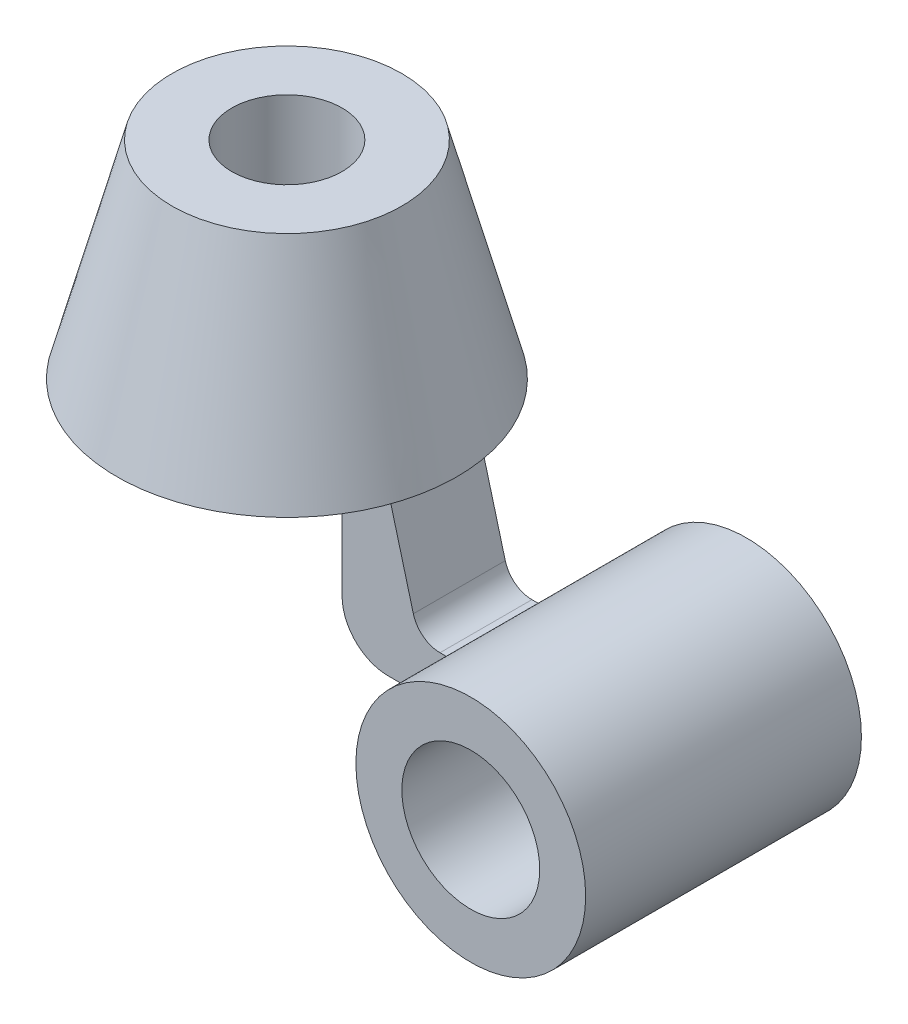
ISO-10303-21;
HEADER;
FILE_DESCRIPTION(('STEP AP214'),'2;1');
FILE_NAME('part.step','',(''),(''),'','','');
FILE_SCHEMA(('AUTOMOTIVE_DESIGN { 1 0 10303 214 1 1 1 1 }'));
ENDSEC;
DATA;
#1=APPLICATION_CONTEXT('core data for automotive mechanical design processes');
#2=APPLICATION_PROTOCOL_DEFINITION('international standard','automotive_design',2000,#1);
#3=PRODUCT_CONTEXT('',#1,'mechanical');
#4=PRODUCT('Part','Part','',(#3));
#5=PRODUCT_RELATED_PRODUCT_CATEGORY('part','',(#4));
#6=PRODUCT_DEFINITION_FORMATION('','',#4);
#7=PRODUCT_DEFINITION_CONTEXT('part definition',#1,'design');
#8=PRODUCT_DEFINITION('design','',#6,#7);
#9=PRODUCT_DEFINITION_SHAPE('','',#8);
#10=(LENGTH_UNIT() NAMED_UNIT(*) SI_UNIT(.MILLI.,.METRE.));
#11=(NAMED_UNIT(*) PLANE_ANGLE_UNIT() SI_UNIT($,.RADIAN.));
#12=(NAMED_UNIT(*) SI_UNIT($,.STERADIAN.) SOLID_ANGLE_UNIT());
#13=UNCERTAINTY_MEASURE_WITH_UNIT(LENGTH_MEASURE(1.E-05),#10,'distance_accuracy_value','');
#14=(GEOMETRIC_REPRESENTATION_CONTEXT(3) GLOBAL_UNCERTAINTY_ASSIGNED_CONTEXT((#13)) GLOBAL_UNIT_ASSIGNED_CONTEXT((#10,
#11,#12)) REPRESENTATION_CONTEXT('',''));
#15=CARTESIAN_POINT('',(0.,0.,0.));
#16=DIRECTION('',(0.,0.,1.));
#17=DIRECTION('',(1.,0.,0.));
#18=AXIS2_PLACEMENT_3D('',#15,#16,#17);
#19=CARTESIAN_POINT('',(37.,0.,0.));
#20=DIRECTION('',(0.,-1.,0.));
#21=DIRECTION('',(0.,0.,-1.));
#22=AXIS2_PLACEMENT_3D('',#19,#20,#21);
#23=PLANE('',#22);
#24=CARTESIAN_POINT('',(0.,0.,0.));
#25=DIRECTION('',(0.,-1.,0.));
#26=DIRECTION('',(0.,0.,-1.));
#27=AXIS2_PLACEMENT_3D('',#24,#25,#26);
#28=CIRCLE('',#27,12.);
#29=CARTESIAN_POINT('',(0.,0.,-12.));
#30=VERTEX_POINT('',#29);
#31=EDGE_CURVE('E47',#30,#30,#28,.T.);
#32=ORIENTED_EDGE('',*,*,#31,.F.);
#33=EDGE_LOOP('',(#32));
#34=FACE_BOUND('',#33,.T.);
#35=CARTESIAN_POINT('',(0.,0.,0.));
#36=DIRECTION('',(0.,-1.,0.));
#37=DIRECTION('',(0.,0.,-1.));
#38=AXIS2_PLACEMENT_3D('',#35,#36,#37);
#39=CIRCLE('',#38,37.);
#40=CARTESIAN_POINT('',(0.,0.,-37.));
#41=VERTEX_POINT('',#40);
#42=EDGE_CURVE('E143',#41,#41,#39,.T.);
#43=ORIENTED_EDGE('',*,*,#42,.T.);
#44=EDGE_LOOP('',(#43));
#45=FACE_BOUND('',#44,.T.);
#46=DIRECTION('',(0.,0.,1.));
#47=VECTOR('',#46,1.);
#48=CARTESIAN_POINT('',(32.,0.,-10.));
#49=LINE('',#48,#47);
#50=CARTESIAN_POINT('',(32.,0.,-10.));
#51=VERTEX_POINT('',#50);
#52=CARTESIAN_POINT('',(32.,0.,10.));
#53=VERTEX_POINT('',#52);
#54=EDGE_CURVE('E192',#51,#53,#49,.T.);
#55=ORIENTED_EDGE('',*,*,#54,.F.);
#56=DIRECTION('',(-1.,0.,0.));
#57=VECTOR('',#56,1.);
#58=CARTESIAN_POINT('',(32.,0.,-10.));
#59=LINE('',#58,#57);
#60=CARTESIAN_POINT('',(22.,0.,-10.));
#61=VERTEX_POINT('',#60);
#62=EDGE_CURVE('E174',#51,#61,#59,.T.);
#63=ORIENTED_EDGE('',*,*,#62,.T.);
#64=DIRECTION('',(0.,0.,1.));
#65=VECTOR('',#64,1.);
#66=CARTESIAN_POINT('',(22.,0.,-10.));
#67=LINE('',#66,#65);
#68=CARTESIAN_POINT('',(22.,0.,10.));
#69=VERTEX_POINT('',#68);
#70=EDGE_CURVE('E191',#61,#69,#67,.T.);
#71=ORIENTED_EDGE('',*,*,#70,.T.);
#72=DIRECTION('',(-1.,0.,0.));
#73=VECTOR('',#72,1.);
#74=CARTESIAN_POINT('',(32.,0.,10.));
#75=LINE('',#74,#73);
#76=EDGE_CURVE('E248',#53,#69,#75,.T.);
#77=ORIENTED_EDGE('',*,*,#76,.F.);
#78=EDGE_LOOP('',(#55,#63,#71,#77));
#79=FACE_BOUND('',#78,.T.);
#80=ADVANCED_FACE('F43',(#34,#45,#79),#23,.T.);
#81=CARTESIAN_POINT('',(0.,45.,0.));
#82=DIRECTION('',(0.,1.,0.));
#83=DIRECTION('',(0.,0.,1.));
#84=AXIS2_PLACEMENT_3D('',#81,#82,#83);
#85=PLANE('',#84);
#86=CARTESIAN_POINT('',(0.,45.,0.));
#87=DIRECTION('',(0.,1.,0.));
#88=DIRECTION('',(0.,0.,1.));
#89=AXIS2_PLACEMENT_3D('',#86,#87,#88);
#90=CIRCLE('',#89,12.);
#91=CARTESIAN_POINT('',(0.,45.,12.));
#92=VERTEX_POINT('',#91);
#93=EDGE_CURVE('E265',#92,#92,#90,.T.);
#94=ORIENTED_EDGE('',*,*,#93,.F.);
#95=EDGE_LOOP('',(#94));
#96=FACE_BOUND('',#95,.T.);
#97=CARTESIAN_POINT('',(0.,45.,0.));
#98=DIRECTION('',(0.,-1.,0.));
#99=DIRECTION('',(0.,0.,-1.));
#100=AXIS2_PLACEMENT_3D('',#97,#98,#99);
#101=CIRCLE('',#100,25.);
#102=CARTESIAN_POINT('',(0.,45.,-25.));
#103=VERTEX_POINT('',#102);
#104=EDGE_CURVE('E136',#103,#103,#101,.T.);
#105=ORIENTED_EDGE('',*,*,#104,.F.);
#106=EDGE_LOOP('',(#105));
#107=FACE_BOUND('',#106,.T.);
#108=ADVANCED_FACE('F206',(#96,#107),#85,.T.);
#109=CARTESIAN_POINT('',(0.,0.,0.));
#110=DIRECTION('',(0.,-1.,0.));
#111=DIRECTION('',(0.,0.,-1.));
#112=AXIS2_PLACEMENT_3D('',#109,#110,#111);
#113=CONICAL_SURFACE('',#112,37.,0.260602391747341);
#114=ORIENTED_EDGE('',*,*,#104,.T.);
#115=EDGE_LOOP('',(#114));
#116=FACE_BOUND('',#115,.T.);
#117=ORIENTED_EDGE('',*,*,#42,.F.);
#118=EDGE_LOOP('',(#117));
#119=FACE_BOUND('',#118,.T.);
#120=ADVANCED_FACE('F203',(#116,#119),#113,.T.);
#121=CARTESIAN_POINT('',(38.6987298107779,-25.,-10.));
#122=DIRECTION('',(0.96592582628907,0.258819045102515,0.));
#123=DIRECTION('',(-0.258819045102515,0.96592582628907,0.));
#124=AXIS2_PLACEMENT_3D('',#121,#122,#123);
#125=PLANE('',#124);
#126=DIRECTION('',(-0.258819045102515,0.96592582628907,0.));
#127=VECTOR('',#126,1.);
#128=CARTESIAN_POINT('',(38.6987298107779,-25.,10.));
#129=LINE('',#128,#127);
#130=CARTESIAN_POINT('',(37.5071367809173,-20.5529142706151,10.));
#131=VERTEX_POINT('',#130);
#132=EDGE_CURVE('E171',#131,#53,#129,.T.);
#133=ORIENTED_EDGE('',*,*,#132,.F.);
#134=DIRECTION('',(0.,0.,1.));
#135=VECTOR('',#134,1.);
#136=CARTESIAN_POINT('',(37.5071367809173,-20.5529142706151,-10.));
#137=LINE('',#136,#135);
#138=CARTESIAN_POINT('',(37.5071367809173,-20.5529142706151,-10.));
#139=VERTEX_POINT('',#138);
#140=EDGE_CURVE('E60',#131,#139,#137,.F.);
#141=ORIENTED_EDGE('',*,*,#140,.T.);
#142=DIRECTION('',(-0.258819045102515,0.96592582628907,0.));
#143=VECTOR('',#142,1.);
#144=CARTESIAN_POINT('',(38.6987298107779,-25.,-10.));
#145=LINE('',#144,#143);
#146=EDGE_CURVE('E188',#139,#51,#145,.T.);
#147=ORIENTED_EDGE('',*,*,#146,.T.);
#148=ORIENTED_EDGE('',*,*,#54,.T.);
#149=EDGE_LOOP('',(#133,#141,#147,#148));
#150=FACE_BOUND('',#149,.T.);
#151=ADVANCED_FACE('F205',(#150),#125,.T.);
#152=CARTESIAN_POINT('',(74.4739299118833,-25.,-10.));
#153=DIRECTION('',(0.,1.,0.));
#154=DIRECTION('',(-1.,0.,0.));
#155=AXIS2_PLACEMENT_3D('',#152,#153,#154);
#156=PLANE('',#155);
#157=DIRECTION('',(-1.,0.,0.));
#158=VECTOR('',#157,1.);
#159=CARTESIAN_POINT('',(74.4739299118833,-25.,-10.));
#160=LINE('',#159,#158);
#161=CARTESIAN_POINT('',(47.0871215252208,-25.,-10.));
#162=VERTEX_POINT('',#161);
#163=CARTESIAN_POINT('',(43.3026917386517,-25.,-10.));
#164=VERTEX_POINT('',#163);
#165=EDGE_CURVE('E167',#162,#164,#160,.T.);
#166=ORIENTED_EDGE('',*,*,#165,.T.);
#167=DIRECTION('',(0.,0.,1.));
#168=VECTOR('',#167,1.);
#169=CARTESIAN_POINT('',(43.3026917386517,-25.,10.));
#170=LINE('',#169,#168);
#171=CARTESIAN_POINT('',(43.3026917386517,-25.,10.));
#172=VERTEX_POINT('',#171);
#173=EDGE_CURVE('E155',#164,#172,#170,.T.);
#174=ORIENTED_EDGE('',*,*,#173,.T.);
#175=DIRECTION('',(-1.,0.,0.));
#176=VECTOR('',#175,1.);
#177=CARTESIAN_POINT('',(74.4739299118833,-25.,10.));
#178=LINE('',#177,#176);
#179=CARTESIAN_POINT('',(47.0871215252208,-25.,10.));
#180=VERTEX_POINT('',#179);
#181=EDGE_CURVE('E117',#180,#172,#178,.T.);
#182=ORIENTED_EDGE('',*,*,#181,.F.);
#183=DIRECTION('',(0.,0.,1.));
#184=VECTOR('',#183,1.);
#185=CARTESIAN_POINT('',(47.0871215252208,-25.,-30.));
#186=LINE('',#185,#184);
#187=EDGE_CURVE('E129',#162,#180,#186,.T.);
#188=ORIENTED_EDGE('',*,*,#187,.F.);
#189=EDGE_LOOP('',(#166,#174,#182,#188));
#190=FACE_BOUND('',#189,.T.);
#191=ADVANCED_FACE('F165',(#190),#156,.T.);
#192=CARTESIAN_POINT('',(22.,-35.,-10.));
#193=DIRECTION('',(0.,-1.,0.));
#194=DIRECTION('',(0.,0.,-1.));
#195=AXIS2_PLACEMENT_3D('',#192,#193,#194);
#196=PLANE('',#195);
#197=DIRECTION('',(1.,0.,0.));
#198=VECTOR('',#197,1.);
#199=CARTESIAN_POINT('',(22.,-35.,10.));
#200=LINE('',#199,#198);
#201=CARTESIAN_POINT('',(32.,-35.,10.));
#202=VERTEX_POINT('',#201);
#203=CARTESIAN_POINT('',(45.,-35.,10.));
#204=VERTEX_POINT('',#203);
#205=EDGE_CURVE('E106',#202,#204,#200,.T.);
#206=ORIENTED_EDGE('',*,*,#205,.F.);
#207=DIRECTION('',(0.,0.,1.));
#208=VECTOR('',#207,1.);
#209=CARTESIAN_POINT('',(32.,-35.,-10.));
#210=LINE('',#209,#208);
#211=CARTESIAN_POINT('',(32.,-35.,-10.));
#212=VERTEX_POINT('',#211);
#213=EDGE_CURVE('E149',#202,#212,#210,.F.);
#214=ORIENTED_EDGE('',*,*,#213,.T.);
#215=DIRECTION('',(1.,0.,0.));
#216=VECTOR('',#215,1.);
#217=CARTESIAN_POINT('',(22.,-35.,-10.));
#218=LINE('',#217,#216);
#219=CARTESIAN_POINT('',(45.,-35.,-10.));
#220=VERTEX_POINT('',#219);
#221=EDGE_CURVE('E124',#212,#220,#218,.T.);
#222=ORIENTED_EDGE('',*,*,#221,.T.);
#223=DIRECTION('',(0.,0.,1.));
#224=VECTOR('',#223,1.);
#225=CARTESIAN_POINT('',(45.,-35.,-30.));
#226=LINE('',#225,#224);
#227=EDGE_CURVE('E121',#204,#220,#226,.F.);
#228=ORIENTED_EDGE('',*,*,#227,.F.);
#229=EDGE_LOOP('',(#206,#214,#222,#228));
#230=FACE_BOUND('',#229,.T.);
#231=ADVANCED_FACE('F122',(#230),#196,.T.);
#232=CARTESIAN_POINT('',(22.,0.,-10.));
#233=DIRECTION('',(-1.,0.,0.));
#234=DIRECTION('',(0.,-1.,0.));
#235=AXIS2_PLACEMENT_3D('',#232,#233,#234);
#236=PLANE('',#235);
#237=DIRECTION('',(0.,-1.,0.));
#238=VECTOR('',#237,1.);
#239=CARTESIAN_POINT('',(22.,0.,-10.));
#240=LINE('',#239,#238);
#241=CARTESIAN_POINT('',(22.,-25.,-10.));
#242=VERTEX_POINT('',#241);
#243=EDGE_CURVE('E180',#61,#242,#240,.T.);
#244=ORIENTED_EDGE('',*,*,#243,.T.);
#245=DIRECTION('',(0.,0.,1.));
#246=VECTOR('',#245,1.);
#247=CARTESIAN_POINT('',(22.,-25.,-10.));
#248=LINE('',#247,#246);
#249=CARTESIAN_POINT('',(22.,-25.,10.));
#250=VERTEX_POINT('',#249);
#251=EDGE_CURVE('E135',#242,#250,#248,.T.);
#252=ORIENTED_EDGE('',*,*,#251,.T.);
#253=DIRECTION('',(0.,-1.,0.));
#254=VECTOR('',#253,1.);
#255=CARTESIAN_POINT('',(22.,0.,10.));
#256=LINE('',#255,#254);
#257=EDGE_CURVE('E118',#69,#250,#256,.T.);
#258=ORIENTED_EDGE('',*,*,#257,.F.);
#259=ORIENTED_EDGE('',*,*,#70,.F.);
#260=EDGE_LOOP('',(#244,#252,#258,#259));
#261=FACE_BOUND('',#260,.T.);
#262=ADVANCED_FACE('F243',(#261),#236,.T.);
#263=CARTESIAN_POINT('',(0.,0.,-10.));
#264=DIRECTION('',(0.,0.,1.));
#265=DIRECTION('',(1.,0.,0.));
#266=AXIS2_PLACEMENT_3D('',#263,#264,#265);
#267=PLANE('',#266);
#268=ORIENTED_EDGE('',*,*,#221,.F.);
#269=CARTESIAN_POINT('',(32.,-25.,-10.));
#270=DIRECTION('',(0.,0.,1.));
#271=DIRECTION('',(1.,0.,0.));
#272=AXIS2_PLACEMENT_3D('',#269,#270,#271);
#273=CIRCLE('',#272,10.);
#274=EDGE_CURVE('E152',#212,#242,#273,.F.);
#275=ORIENTED_EDGE('',*,*,#274,.T.);
#276=ORIENTED_EDGE('',*,*,#243,.F.);
#277=ORIENTED_EDGE('',*,*,#62,.F.);
#278=ORIENTED_EDGE('',*,*,#146,.F.);
#279=CARTESIAN_POINT('',(43.3026917386517,-19.,-10.));
#280=DIRECTION('',(0.,0.,1.));
#281=DIRECTION('',(1.,0.,0.));
#282=AXIS2_PLACEMENT_3D('',#279,#280,#281);
#283=CIRCLE('',#282,6.);
#284=EDGE_CURVE('E11',#139,#164,#283,.T.);
#285=ORIENTED_EDGE('',*,*,#284,.T.);
#286=ORIENTED_EDGE('',*,*,#165,.F.);
#287=CARTESIAN_POINT('',(70.,-35.,-10.));
#288=DIRECTION('',(0.,0.,1.));
#289=DIRECTION('',(1.,0.,0.));
#290=AXIS2_PLACEMENT_3D('',#287,#288,#289);
#291=CIRCLE('',#290,25.);
#292=EDGE_CURVE('E250',#162,#220,#291,.T.);
#293=ORIENTED_EDGE('',*,*,#292,.T.);
#294=EDGE_LOOP('',(#268,#275,#276,#277,#278,#285,#286,#293));
#295=FACE_BOUND('',#294,.T.);
#296=ADVANCED_FACE('F239',(#295),#267,.F.);
#297=CARTESIAN_POINT('',(0.,0.,10.));
#298=DIRECTION('',(0.,0.,1.));
#299=DIRECTION('',(1.,0.,0.));
#300=AXIS2_PLACEMENT_3D('',#297,#298,#299);
#301=PLANE('',#300);
#302=ORIENTED_EDGE('',*,*,#257,.T.);
#303=CARTESIAN_POINT('',(32.,-25.,10.));
#304=DIRECTION('',(0.,0.,1.));
#305=DIRECTION('',(1.,0.,0.));
#306=AXIS2_PLACEMENT_3D('',#303,#304,#305);
#307=CIRCLE('',#306,10.);
#308=EDGE_CURVE('E113',#250,#202,#307,.T.);
#309=ORIENTED_EDGE('',*,*,#308,.T.);
#310=ORIENTED_EDGE('',*,*,#205,.T.);
#311=CARTESIAN_POINT('',(70.,-35.,10.));
#312=DIRECTION('',(0.,0.,1.));
#313=DIRECTION('',(1.,0.,0.));
#314=AXIS2_PLACEMENT_3D('',#311,#312,#313);
#315=CIRCLE('',#314,25.);
#316=EDGE_CURVE('E111',#180,#204,#315,.T.);
#317=ORIENTED_EDGE('',*,*,#316,.F.);
#318=ORIENTED_EDGE('',*,*,#181,.T.);
#319=CARTESIAN_POINT('',(43.3026917386517,-19.,10.));
#320=DIRECTION('',(0.,0.,1.));
#321=DIRECTION('',(1.,0.,0.));
#322=AXIS2_PLACEMENT_3D('',#319,#320,#321);
#323=CIRCLE('',#322,6.);
#324=EDGE_CURVE('E53',#172,#131,#323,.F.);
#325=ORIENTED_EDGE('',*,*,#324,.T.);
#326=ORIENTED_EDGE('',*,*,#132,.T.);
#327=ORIENTED_EDGE('',*,*,#76,.T.);
#328=EDGE_LOOP('',(#302,#309,#310,#317,#318,#325,#326,#327));
#329=FACE_BOUND('',#328,.T.);
#330=ADVANCED_FACE('F109',(#329),#301,.T.);
#331=CARTESIAN_POINT('',(70.,-35.,-30.));
#332=DIRECTION('',(0.,0.,1.));
#333=DIRECTION('',(1.,0.,0.));
#334=AXIS2_PLACEMENT_3D('',#331,#332,#333);
#335=CYLINDRICAL_SURFACE('',#334,25.);
#336=CARTESIAN_POINT('',(70.,-35.,30.));
#337=DIRECTION('',(0.,0.,1.));
#338=DIRECTION('',(1.,0.,0.));
#339=AXIS2_PLACEMENT_3D('',#336,#337,#338);
#340=CIRCLE('',#339,25.);
#341=CARTESIAN_POINT('',(95.,-35.,30.));
#342=VERTEX_POINT('',#341);
#343=EDGE_CURVE('E261',#342,#342,#340,.T.);
#344=ORIENTED_EDGE('',*,*,#343,.F.);
#345=EDGE_LOOP('',(#344));
#346=FACE_BOUND('',#345,.T.);
#347=CARTESIAN_POINT('',(70.,-35.,-30.));
#348=DIRECTION('',(0.,0.,1.));
#349=DIRECTION('',(1.,0.,0.));
#350=AXIS2_PLACEMENT_3D('',#347,#348,#349);
#351=CIRCLE('',#350,25.);
#352=CARTESIAN_POINT('',(95.,-35.,-30.));
#353=VERTEX_POINT('',#352);
#354=EDGE_CURVE('E130',#353,#353,#351,.T.);
#355=ORIENTED_EDGE('',*,*,#354,.T.);
#356=EDGE_LOOP('',(#355));
#357=FACE_BOUND('',#356,.T.);
#358=ORIENTED_EDGE('',*,*,#292,.F.);
#359=ORIENTED_EDGE('',*,*,#187,.T.);
#360=ORIENTED_EDGE('',*,*,#316,.T.);
#361=ORIENTED_EDGE('',*,*,#227,.T.);
#362=EDGE_LOOP('',(#358,#359,#360,#361));
#363=FACE_BOUND('',#362,.T.);
#364=ADVANCED_FACE('F133',(#346,#357,#363),#335,.T.);
#365=CARTESIAN_POINT('',(70.,-35.,-30.));
#366=DIRECTION('',(0.,0.,1.));
#367=DIRECTION('',(1.,0.,0.));
#368=AXIS2_PLACEMENT_3D('',#365,#366,#367);
#369=PLANE('',#368);
#370=CARTESIAN_POINT('',(70.,-35.,-30.));
#371=DIRECTION('',(0.,0.,1.));
#372=DIRECTION('',(1.,0.,0.));
#373=AXIS2_PLACEMENT_3D('',#370,#371,#372);
#374=CIRCLE('',#373,15.);
#375=CARTESIAN_POINT('',(85.,-35.,-30.));
#376=VERTEX_POINT('',#375);
#377=EDGE_CURVE('E269',#376,#376,#374,.T.);
#378=ORIENTED_EDGE('',*,*,#377,.T.);
#379=EDGE_LOOP('',(#378));
#380=FACE_BOUND('',#379,.T.);
#381=ORIENTED_EDGE('',*,*,#354,.F.);
#382=EDGE_LOOP('',(#381));
#383=FACE_BOUND('',#382,.T.);
#384=ADVANCED_FACE('F232',(#380,#383),#369,.F.);
#385=CARTESIAN_POINT('',(70.,-35.,30.));
#386=DIRECTION('',(0.,0.,1.));
#387=DIRECTION('',(1.,0.,0.));
#388=AXIS2_PLACEMENT_3D('',#385,#386,#387);
#389=PLANE('',#388);
#390=CARTESIAN_POINT('',(70.,-35.,30.));
#391=DIRECTION('',(0.,0.,1.));
#392=DIRECTION('',(1.,0.,0.));
#393=AXIS2_PLACEMENT_3D('',#390,#391,#392);
#394=CIRCLE('',#393,15.);
#395=CARTESIAN_POINT('',(85.,-35.,30.));
#396=VERTEX_POINT('',#395);
#397=EDGE_CURVE('E273',#396,#396,#394,.T.);
#398=ORIENTED_EDGE('',*,*,#397,.F.);
#399=EDGE_LOOP('',(#398));
#400=FACE_BOUND('',#399,.T.);
#401=ORIENTED_EDGE('',*,*,#343,.T.);
#402=EDGE_LOOP('',(#401));
#403=FACE_BOUND('',#402,.T.);
#404=ADVANCED_FACE('F225',(#400,#403),#389,.T.);
#405=CARTESIAN_POINT('',(32.,-25.,-10.));
#406=DIRECTION('',(0.,0.,1.));
#407=DIRECTION('',(1.,0.,0.));
#408=AXIS2_PLACEMENT_3D('',#405,#406,#407);
#409=CYLINDRICAL_SURFACE('',#408,10.);
#410=ORIENTED_EDGE('',*,*,#274,.F.);
#411=ORIENTED_EDGE('',*,*,#213,.F.);
#412=ORIENTED_EDGE('',*,*,#308,.F.);
#413=ORIENTED_EDGE('',*,*,#251,.F.);
#414=EDGE_LOOP('',(#410,#411,#412,#413));
#415=FACE_BOUND('',#414,.T.);
#416=ADVANCED_FACE('F223',(#415),#409,.T.);
#417=CARTESIAN_POINT('',(43.3026917386517,-19.,-10.));
#418=DIRECTION('',(0.,0.,-1.));
#419=DIRECTION('',(-1.,0.,0.));
#420=AXIS2_PLACEMENT_3D('',#417,#418,#419);
#421=CYLINDRICAL_SURFACE('',#420,6.);
#422=ORIENTED_EDGE('',*,*,#284,.F.);
#423=ORIENTED_EDGE('',*,*,#140,.F.);
#424=ORIENTED_EDGE('',*,*,#324,.F.);
#425=ORIENTED_EDGE('',*,*,#173,.F.);
#426=EDGE_LOOP('',(#422,#423,#424,#425));
#427=FACE_BOUND('',#426,.T.);
#428=ADVANCED_FACE('F45',(#427),#421,.F.);
#429=CARTESIAN_POINT('',(0.,45.,0.));
#430=DIRECTION('',(0.,1.,0.));
#431=DIRECTION('',(0.,0.,1.));
#432=AXIS2_PLACEMENT_3D('',#429,#430,#431);
#433=CYLINDRICAL_SURFACE('',#432,12.);
#434=ORIENTED_EDGE('',*,*,#31,.T.);
#435=EDGE_LOOP('',(#434));
#436=FACE_BOUND('',#435,.T.);
#437=ORIENTED_EDGE('',*,*,#93,.T.);
#438=EDGE_LOOP('',(#437));
#439=FACE_BOUND('',#438,.T.);
#440=ADVANCED_FACE('F231',(#436,#439),#433,.F.);
#441=CARTESIAN_POINT('',(70.,-35.,30.));
#442=DIRECTION('',(0.,0.,1.));
#443=DIRECTION('',(1.,0.,0.));
#444=AXIS2_PLACEMENT_3D('',#441,#442,#443);
#445=CYLINDRICAL_SURFACE('',#444,15.);
#446=ORIENTED_EDGE('',*,*,#397,.T.);
#447=EDGE_LOOP('',(#446));
#448=FACE_BOUND('',#447,.T.);
#449=ORIENTED_EDGE('',*,*,#377,.F.);
#450=EDGE_LOOP('',(#449));
#451=FACE_BOUND('',#450,.T.);
#452=ADVANCED_FACE('F278',(#448,#451),#445,.F.);
#453=CLOSED_SHELL('',(#80,#108,#120,#151,#191,#231,#262,#296,#330,#364,#384,#404,#416,#428,#440,#452));
#454=MANIFOLD_SOLID_BREP('B2',#453);
#455=ADVANCED_BREP_SHAPE_REPRESENTATION('',(#18,#454),#14);
#456=SHAPE_DEFINITION_REPRESENTATION(#9,#455);
ENDSEC;
END-ISO-10303-21;
